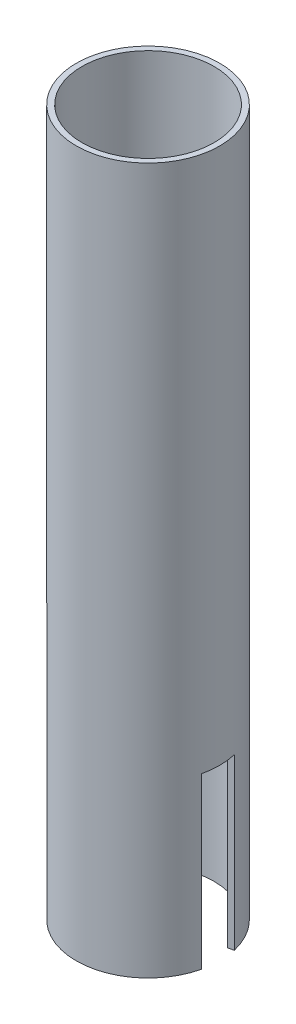
ISO-10303-21;
HEADER;
FILE_DESCRIPTION(('STEP AP214'),'2;1');
FILE_NAME('part.step','',(''),(''),'','','');
FILE_SCHEMA(('AUTOMOTIVE_DESIGN { 1 0 10303 214 1 1 1 1 }'));
ENDSEC;
DATA;
#1=APPLICATION_CONTEXT('core data for automotive mechanical design processes');
#2=APPLICATION_PROTOCOL_DEFINITION('international standard','automotive_design',2000,#1);
#3=PRODUCT_CONTEXT('',#1,'mechanical');
#4=PRODUCT('Part','Part','',(#3));
#5=PRODUCT_RELATED_PRODUCT_CATEGORY('part','',(#4));
#6=PRODUCT_DEFINITION_FORMATION('','',#4);
#7=PRODUCT_DEFINITION_CONTEXT('part definition',#1,'design');
#8=PRODUCT_DEFINITION('design','',#6,#7);
#9=PRODUCT_DEFINITION_SHAPE('','',#8);
#10=(LENGTH_UNIT() NAMED_UNIT(*) SI_UNIT(.MILLI.,.METRE.));
#11=(NAMED_UNIT(*) PLANE_ANGLE_UNIT() SI_UNIT($,.RADIAN.));
#12=(NAMED_UNIT(*) SI_UNIT($,.STERADIAN.) SOLID_ANGLE_UNIT());
#13=UNCERTAINTY_MEASURE_WITH_UNIT(LENGTH_MEASURE(1.E-05),#10,'distance_accuracy_value','');
#14=(GEOMETRIC_REPRESENTATION_CONTEXT(3) GLOBAL_UNCERTAINTY_ASSIGNED_CONTEXT((#13)) GLOBAL_UNIT_ASSIGNED_CONTEXT((#10,
#11,#12)) REPRESENTATION_CONTEXT('',''));
#15=CARTESIAN_POINT('',(0.,0.,0.));
#16=DIRECTION('',(0.,0.,1.));
#17=DIRECTION('',(1.,0.,0.));
#18=AXIS2_PLACEMENT_3D('',#15,#16,#17);
#19=CARTESIAN_POINT('',(0.,-125.,0.));
#20=DIRECTION('',(0.,1.,0.));
#21=DIRECTION('',(0.,0.,1.));
#22=AXIS2_PLACEMENT_3D('',#19,#20,#21);
#23=PLANE('',#22);
#24=CARTESIAN_POINT('',(0.,-125.,0.));
#25=DIRECTION('',(0.,1.,0.));
#26=DIRECTION('',(0.,0.,1.));
#27=AXIS2_PLACEMENT_3D('',#24,#25,#26);
#28=CIRCLE('',#27,25.4);
#29=CARTESIAN_POINT('',(-24.719681160537,-125.,5.83929476233157));
#30=VERTEX_POINT('',#29);
#31=CARTESIAN_POINT('',(24.719681160537,-125.,5.83929476233158));
#32=VERTEX_POINT('',#31);
#33=EDGE_CURVE('E94',#30,#32,#28,.T.);
#34=ORIENTED_EDGE('',*,*,#33,.F.);
#35=DIRECTION('',(-0.973215793721929,0.,0.229893494579982));
#36=VECTOR('',#35,1.);
#37=CARTESIAN_POINT('',(-24.719681160537,-125.,5.83929476233157));
#38=LINE('',#37,#36);
#39=CARTESIAN_POINT('',(-22.7732495730931,-125.,5.37950777317161));
#40=VERTEX_POINT('',#39);
#41=EDGE_CURVE('E171',#40,#30,#38,.T.);
#42=ORIENTED_EDGE('',*,*,#41,.F.);
#43=CARTESIAN_POINT('',(0.,-125.,0.));
#44=DIRECTION('',(0.,1.,0.));
#45=DIRECTION('',(0.,0.,1.));
#46=AXIS2_PLACEMENT_3D('',#43,#44,#45);
#47=CIRCLE('',#46,23.4);
#48=CARTESIAN_POINT('',(22.7732495730931,-125.,5.37950777317161));
#49=VERTEX_POINT('',#48);
#50=EDGE_CURVE('E208',#40,#49,#47,.T.);
#51=ORIENTED_EDGE('',*,*,#50,.T.);
#52=DIRECTION('',(-0.973215793721929,0.,-0.229893494579983));
#53=VECTOR('',#52,1.);
#54=CARTESIAN_POINT('',(24.719681160537,-125.,5.83929476233158));
#55=LINE('',#54,#53);
#56=EDGE_CURVE('E194',#32,#49,#55,.T.);
#57=ORIENTED_EDGE('',*,*,#56,.F.);
#58=EDGE_LOOP('',(#34,#42,#51,#57));
#59=FACE_BOUND('',#58,.T.);
#60=ADVANCED_FACE('F90',(#59),#23,.F.);
#61=CARTESIAN_POINT('',(0.,125.,0.));
#62=DIRECTION('',(0.,1.,0.));
#63=DIRECTION('',(0.,0.,1.));
#64=AXIS2_PLACEMENT_3D('',#61,#62,#63);
#65=PLANE('',#64);
#66=CARTESIAN_POINT('',(0.,125.,0.));
#67=DIRECTION('',(0.,1.,0.));
#68=DIRECTION('',(0.,0.,1.));
#69=AXIS2_PLACEMENT_3D('',#66,#67,#68);
#70=CIRCLE('',#69,25.4);
#71=CARTESIAN_POINT('',(0.,125.,25.4));
#72=VERTEX_POINT('',#71);
#73=EDGE_CURVE('E12',#72,#72,#70,.T.);
#74=ORIENTED_EDGE('',*,*,#73,.T.);
#75=EDGE_LOOP('',(#74));
#76=FACE_BOUND('',#75,.T.);
#77=CARTESIAN_POINT('',(0.,125.,0.));
#78=DIRECTION('',(0.,1.,0.));
#79=DIRECTION('',(0.,0.,1.));
#80=AXIS2_PLACEMENT_3D('',#77,#78,#79);
#81=CIRCLE('',#80,23.4);
#82=CARTESIAN_POINT('',(0.,125.,23.4));
#83=VERTEX_POINT('',#82);
#84=EDGE_CURVE('E204',#83,#83,#81,.T.);
#85=ORIENTED_EDGE('',*,*,#84,.F.);
#86=EDGE_LOOP('',(#85));
#87=FACE_BOUND('',#86,.T.);
#88=ADVANCED_FACE('F243',(#76,#87),#65,.T.);
#89=CARTESIAN_POINT('',(22.7732495730931,-125.,-5.37950777317161));
#90=VERTEX_POINT('',#89);
#91=CARTESIAN_POINT('',(-22.7732495730931,-125.,-5.37950777317161));
#92=VERTEX_POINT('',#91);
#93=EDGE_CURVE('E207',#90,#92,#47,.T.);
#94=ORIENTED_EDGE('',*,*,#93,.T.);
#95=DIRECTION('',(0.973215793721929,0.,0.229893494579982));
#96=VECTOR('',#95,1.);
#97=CARTESIAN_POINT('',(-24.719681160537,-125.,-5.83929476233157));
#98=LINE('',#97,#96);
#99=CARTESIAN_POINT('',(-24.719681160537,-125.,-5.83929476233157));
#100=VERTEX_POINT('',#99);
#101=EDGE_CURVE('E197',#100,#92,#98,.T.);
#102=ORIENTED_EDGE('',*,*,#101,.F.);
#103=CARTESIAN_POINT('',(24.719681160537,-125.,-5.83929476233158));
#104=VERTEX_POINT('',#103);
#105=EDGE_CURVE('E99',#104,#100,#28,.T.);
#106=ORIENTED_EDGE('',*,*,#105,.F.);
#107=DIRECTION('',(0.973215793721929,0.,-0.229893494579983));
#108=VECTOR('',#107,1.);
#109=CARTESIAN_POINT('',(24.719681160537,-125.,-5.83929476233158));
#110=LINE('',#109,#108);
#111=EDGE_CURVE('E192',#90,#104,#110,.T.);
#112=ORIENTED_EDGE('',*,*,#111,.F.);
#113=EDGE_LOOP('',(#94,#102,#106,#112));
#114=FACE_BOUND('',#113,.T.);
#115=ADVANCED_FACE('F241',(#114),#23,.F.);
#116=CARTESIAN_POINT('',(0.,125.,0.));
#117=DIRECTION('',(0.,-1.,0.));
#118=DIRECTION('',(0.,0.,-1.));
#119=AXIS2_PLACEMENT_3D('',#116,#117,#118);
#120=CYLINDRICAL_SURFACE('',#119,25.4);
#121=ORIENTED_EDGE('',*,*,#73,.F.);
#122=EDGE_LOOP('',(#121));
#123=FACE_BOUND('',#122,.T.);
#124=CARTESIAN_POINT('',(0.,-65.,0.));
#125=DIRECTION('',(0.,-1.,0.));
#126=DIRECTION('',(0.,0.,-1.));
#127=AXIS2_PLACEMENT_3D('',#124,#125,#126);
#128=CIRCLE('',#127,25.4);
#129=CARTESIAN_POINT('',(-24.719681160537,-65.,5.83929476233157));
#130=VERTEX_POINT('',#129);
#131=CARTESIAN_POINT('',(-24.719681160537,-65.,-5.83929476233157));
#132=VERTEX_POINT('',#131);
#133=EDGE_CURVE('E162',#130,#132,#128,.T.);
#134=ORIENTED_EDGE('',*,*,#133,.F.);
#135=DIRECTION('',(0.,-1.,0.));
#136=VECTOR('',#135,1.);
#137=CARTESIAN_POINT('',(-24.719681160537,-65.,5.83929476233157));
#138=LINE('',#137,#136);
#139=EDGE_CURVE('E210',#130,#30,#138,.T.);
#140=ORIENTED_EDGE('',*,*,#139,.T.);
#141=ORIENTED_EDGE('',*,*,#33,.T.);
#142=DIRECTION('',(0.,-1.,0.));
#143=VECTOR('',#142,1.);
#144=CARTESIAN_POINT('',(24.719681160537,-65.,5.83929476233158));
#145=LINE('',#144,#143);
#146=CARTESIAN_POINT('',(24.719681160537,-65.,5.83929476233158));
#147=VERTEX_POINT('',#146);
#148=EDGE_CURVE('E182',#147,#32,#145,.T.);
#149=ORIENTED_EDGE('',*,*,#148,.F.);
#150=CARTESIAN_POINT('',(0.,-65.,0.));
#151=DIRECTION('',(0.,-1.,0.));
#152=DIRECTION('',(0.,0.,-1.));
#153=AXIS2_PLACEMENT_3D('',#150,#151,#152);
#154=CIRCLE('',#153,25.4);
#155=CARTESIAN_POINT('',(24.719681160537,-65.,-5.83929476233158));
#156=VERTEX_POINT('',#155);
#157=EDGE_CURVE('E195',#156,#147,#154,.T.);
#158=ORIENTED_EDGE('',*,*,#157,.F.);
#159=DIRECTION('',(0.,-1.,0.));
#160=VECTOR('',#159,1.);
#161=CARTESIAN_POINT('',(24.719681160537,-65.,-5.83929476233158));
#162=LINE('',#161,#160);
#163=EDGE_CURVE('E190',#156,#104,#162,.T.);
#164=ORIENTED_EDGE('',*,*,#163,.T.);
#165=ORIENTED_EDGE('',*,*,#105,.T.);
#166=DIRECTION('',(0.,-1.,0.));
#167=VECTOR('',#166,1.);
#168=CARTESIAN_POINT('',(-24.719681160537,-65.,-5.83929476233157));
#169=LINE('',#168,#167);
#170=EDGE_CURVE('E156',#132,#100,#169,.T.);
#171=ORIENTED_EDGE('',*,*,#170,.F.);
#172=EDGE_LOOP('',(#134,#140,#141,#149,#158,#164,#165,#171));
#173=FACE_BOUND('',#172,.T.);
#174=ADVANCED_FACE('F92',(#123,#173),#120,.T.);
#175=CARTESIAN_POINT('',(0.,125.,0.));
#176=DIRECTION('',(0.,-1.,0.));
#177=DIRECTION('',(0.,0.,-1.));
#178=AXIS2_PLACEMENT_3D('',#175,#176,#177);
#179=CYLINDRICAL_SURFACE('',#178,23.4);
#180=DIRECTION('',(0.,-1.,0.));
#181=VECTOR('',#180,1.);
#182=CARTESIAN_POINT('',(-22.7732495730931,-65.,5.37950777317161));
#183=LINE('',#182,#181);
#184=CARTESIAN_POINT('',(-22.7732495730931,-65.,5.37950777317161));
#185=VERTEX_POINT('',#184);
#186=EDGE_CURVE('E177',#185,#40,#183,.T.);
#187=ORIENTED_EDGE('',*,*,#186,.F.);
#188=CARTESIAN_POINT('',(0.,-65.,0.));
#189=DIRECTION('',(0.,1.,0.));
#190=DIRECTION('',(0.,0.,-1.));
#191=AXIS2_PLACEMENT_3D('',#188,#189,#190);
#192=CIRCLE('',#191,23.4);
#193=CARTESIAN_POINT('',(-22.7732495730931,-65.,-5.37950777317161));
#194=VERTEX_POINT('',#193);
#195=EDGE_CURVE('E161',#194,#185,#192,.T.);
#196=ORIENTED_EDGE('',*,*,#195,.F.);
#197=DIRECTION('',(0.,-1.,0.));
#198=VECTOR('',#197,1.);
#199=CARTESIAN_POINT('',(-22.7732495730931,-65.,-5.37950777317161));
#200=LINE('',#199,#198);
#201=EDGE_CURVE('E159',#194,#92,#200,.T.);
#202=ORIENTED_EDGE('',*,*,#201,.T.);
#203=ORIENTED_EDGE('',*,*,#93,.F.);
#204=DIRECTION('',(0.,-1.,0.));
#205=VECTOR('',#204,1.);
#206=CARTESIAN_POINT('',(22.7732495730931,-65.,-5.37950777317161));
#207=LINE('',#206,#205);
#208=CARTESIAN_POINT('',(22.7732495730931,-65.,-5.37950777317161));
#209=VERTEX_POINT('',#208);
#210=EDGE_CURVE('E188',#209,#90,#207,.T.);
#211=ORIENTED_EDGE('',*,*,#210,.F.);
#212=CARTESIAN_POINT('',(0.,-65.,0.));
#213=DIRECTION('',(0.,1.,0.));
#214=DIRECTION('',(0.,0.,-1.));
#215=AXIS2_PLACEMENT_3D('',#212,#213,#214);
#216=CIRCLE('',#215,23.4);
#217=CARTESIAN_POINT('',(22.7732495730931,-65.,5.37950777317161));
#218=VERTEX_POINT('',#217);
#219=EDGE_CURVE('E200',#218,#209,#216,.T.);
#220=ORIENTED_EDGE('',*,*,#219,.F.);
#221=DIRECTION('',(0.,-1.,0.));
#222=VECTOR('',#221,1.);
#223=CARTESIAN_POINT('',(22.7732495730931,-65.,5.37950777317161));
#224=LINE('',#223,#222);
#225=EDGE_CURVE('E185',#218,#49,#224,.T.);
#226=ORIENTED_EDGE('',*,*,#225,.T.);
#227=ORIENTED_EDGE('',*,*,#50,.F.);
#228=EDGE_LOOP('',(#187,#196,#202,#203,#211,#220,#226,#227));
#229=FACE_BOUND('',#228,.T.);
#230=ORIENTED_EDGE('',*,*,#84,.T.);
#231=EDGE_LOOP('',(#230));
#232=FACE_BOUND('',#231,.T.);
#233=ADVANCED_FACE('F226',(#229,#232),#179,.F.);
#234=CARTESIAN_POINT('',(24.719681160537,-65.,-5.83929476233158));
#235=DIRECTION('',(-0.229893494579983,0.,-0.973215793721929));
#236=DIRECTION('',(-0.973215793721929,0.,0.229893494579983));
#237=AXIS2_PLACEMENT_3D('',#234,#235,#236);
#238=PLANE('',#237);
#239=ORIENTED_EDGE('',*,*,#111,.T.);
#240=ORIENTED_EDGE('',*,*,#163,.F.);
#241=DIRECTION('',(0.973215793721929,0.,-0.229893494579983));
#242=VECTOR('',#241,1.);
#243=CARTESIAN_POINT('',(24.719681160537,-65.,-5.83929476233158));
#244=LINE('',#243,#242);
#245=EDGE_CURVE('E184',#209,#156,#244,.T.);
#246=ORIENTED_EDGE('',*,*,#245,.F.);
#247=ORIENTED_EDGE('',*,*,#210,.T.);
#248=EDGE_LOOP('',(#239,#240,#246,#247));
#249=FACE_BOUND('',#248,.T.);
#250=ADVANCED_FACE('F237',(#249),#238,.F.);
#251=CARTESIAN_POINT('',(24.719681160537,-65.,5.83929476233158));
#252=DIRECTION('',(-0.229893494579983,0.,0.973215793721929));
#253=DIRECTION('',(0.973215793721929,0.,0.229893494579983));
#254=AXIS2_PLACEMENT_3D('',#251,#252,#253);
#255=PLANE('',#254);
#256=ORIENTED_EDGE('',*,*,#56,.T.);
#257=ORIENTED_EDGE('',*,*,#225,.F.);
#258=DIRECTION('',(-0.973215793721929,0.,-0.229893494579983));
#259=VECTOR('',#258,1.);
#260=CARTESIAN_POINT('',(24.719681160537,-65.,5.83929476233158));
#261=LINE('',#260,#259);
#262=EDGE_CURVE('E114',#147,#218,#261,.T.);
#263=ORIENTED_EDGE('',*,*,#262,.F.);
#264=ORIENTED_EDGE('',*,*,#148,.T.);
#265=EDGE_LOOP('',(#256,#257,#263,#264));
#266=FACE_BOUND('',#265,.T.);
#267=ADVANCED_FACE('F231',(#266),#255,.F.);
#268=CARTESIAN_POINT('',(0.,-65.,0.));
#269=DIRECTION('',(0.,-1.,0.));
#270=DIRECTION('',(0.,0.,-1.));
#271=AXIS2_PLACEMENT_3D('',#268,#269,#270);
#272=PLANE('',#271);
#273=ORIENTED_EDGE('',*,*,#157,.T.);
#274=ORIENTED_EDGE('',*,*,#262,.T.);
#275=ORIENTED_EDGE('',*,*,#219,.T.);
#276=ORIENTED_EDGE('',*,*,#245,.T.);
#277=EDGE_LOOP('',(#273,#274,#275,#276));
#278=FACE_BOUND('',#277,.T.);
#279=ADVANCED_FACE('F234',(#278),#272,.T.);
#280=CARTESIAN_POINT('',(-24.719681160537,-65.,5.83929476233157));
#281=DIRECTION('',(0.229893494579982,0.,0.973215793721929));
#282=DIRECTION('',(0.973215793721929,0.,-0.229893494579982));
#283=AXIS2_PLACEMENT_3D('',#280,#281,#282);
#284=PLANE('',#283);
#285=ORIENTED_EDGE('',*,*,#41,.T.);
#286=ORIENTED_EDGE('',*,*,#139,.F.);
#287=DIRECTION('',(-0.973215793721929,0.,0.229893494579982));
#288=VECTOR('',#287,1.);
#289=CARTESIAN_POINT('',(-24.719681160537,-65.,5.83929476233157));
#290=LINE('',#289,#288);
#291=EDGE_CURVE('E168',#185,#130,#290,.T.);
#292=ORIENTED_EDGE('',*,*,#291,.F.);
#293=ORIENTED_EDGE('',*,*,#186,.T.);
#294=EDGE_LOOP('',(#285,#286,#292,#293));
#295=FACE_BOUND('',#294,.T.);
#296=ADVANCED_FACE('F225',(#295),#284,.F.);
#297=CARTESIAN_POINT('',(-24.719681160537,-65.,-5.83929476233157));
#298=DIRECTION('',(0.229893494579982,0.,-0.973215793721929));
#299=DIRECTION('',(-0.973215793721929,0.,-0.229893494579982));
#300=AXIS2_PLACEMENT_3D('',#297,#298,#299);
#301=PLANE('',#300);
#302=ORIENTED_EDGE('',*,*,#101,.T.);
#303=ORIENTED_EDGE('',*,*,#201,.F.);
#304=DIRECTION('',(0.973215793721929,0.,0.229893494579982));
#305=VECTOR('',#304,1.);
#306=CARTESIAN_POINT('',(-24.719681160537,-65.,-5.83929476233157));
#307=LINE('',#306,#305);
#308=EDGE_CURVE('E106',#132,#194,#307,.T.);
#309=ORIENTED_EDGE('',*,*,#308,.F.);
#310=ORIENTED_EDGE('',*,*,#170,.T.);
#311=EDGE_LOOP('',(#302,#303,#309,#310));
#312=FACE_BOUND('',#311,.T.);
#313=ADVANCED_FACE('F154',(#312),#301,.F.);
#314=CARTESIAN_POINT('',(0.,-65.,0.));
#315=DIRECTION('',(0.,-1.,0.));
#316=DIRECTION('',(0.,0.,-1.));
#317=AXIS2_PLACEMENT_3D('',#314,#315,#316);
#318=PLANE('',#317);
#319=ORIENTED_EDGE('',*,*,#133,.T.);
#320=ORIENTED_EDGE('',*,*,#308,.T.);
#321=ORIENTED_EDGE('',*,*,#195,.T.);
#322=ORIENTED_EDGE('',*,*,#291,.T.);
#323=EDGE_LOOP('',(#319,#320,#321,#322));
#324=FACE_BOUND('',#323,.T.);
#325=ADVANCED_FACE('F166',(#324),#318,.T.);
#326=CLOSED_SHELL('',(#60,#88,#115,#174,#233,#250,#267,#279,#296,#313,#325));
#327=MANIFOLD_SOLID_BREP('B2',#326);
#328=ADVANCED_BREP_SHAPE_REPRESENTATION('',(#18,#327),#14);
#329=SHAPE_DEFINITION_REPRESENTATION(#9,#328);
ENDSEC;
END-ISO-10303-21;
